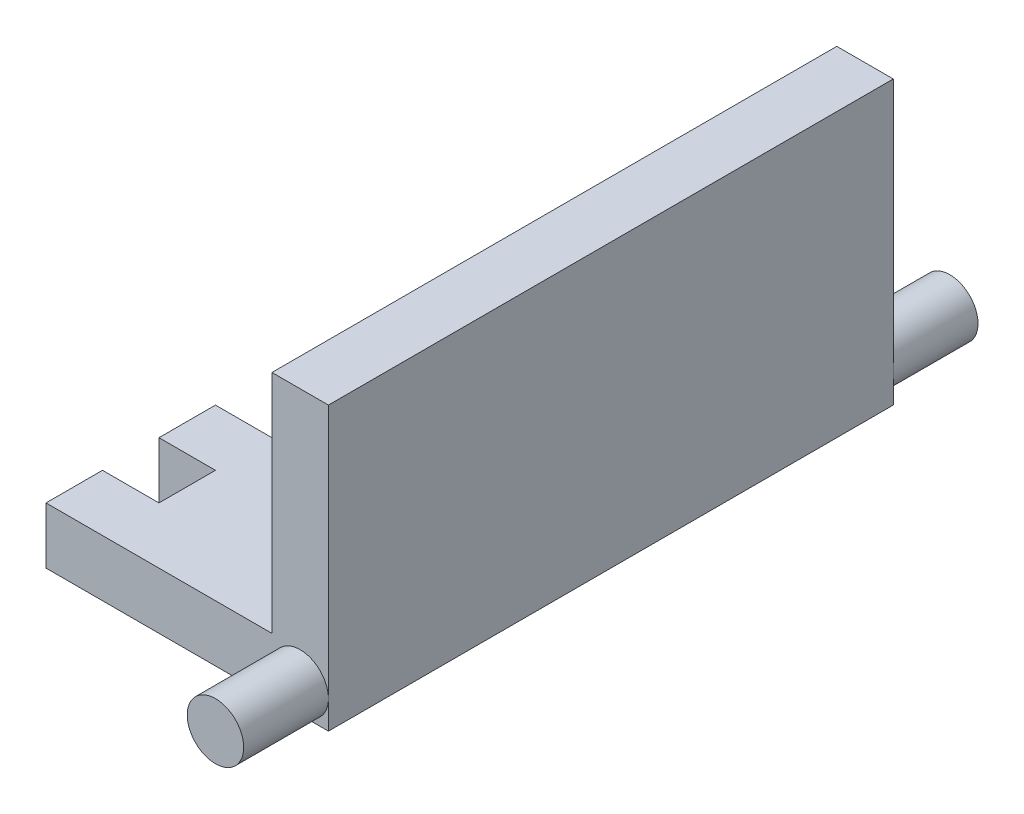
ISO-10303-21;
HEADER;
FILE_DESCRIPTION(('STEP AP214'),'2;1');
FILE_NAME('part.step','',(''),(''),'','','');
FILE_SCHEMA(('AUTOMOTIVE_DESIGN { 1 0 10303 214 1 1 1 1 }'));
ENDSEC;
DATA;
#1=APPLICATION_CONTEXT('core data for automotive mechanical design processes');
#2=APPLICATION_PROTOCOL_DEFINITION('international standard','automotive_design',2000,#1);
#3=PRODUCT_CONTEXT('',#1,'mechanical');
#4=PRODUCT('Part','Part','',(#3));
#5=PRODUCT_RELATED_PRODUCT_CATEGORY('part','',(#4));
#6=PRODUCT_DEFINITION_FORMATION('','',#4);
#7=PRODUCT_DEFINITION_CONTEXT('part definition',#1,'design');
#8=PRODUCT_DEFINITION('design','',#6,#7);
#9=PRODUCT_DEFINITION_SHAPE('','',#8);
#10=(LENGTH_UNIT() NAMED_UNIT(*) SI_UNIT(.MILLI.,.METRE.));
#11=(NAMED_UNIT(*) PLANE_ANGLE_UNIT() SI_UNIT($,.RADIAN.));
#12=(NAMED_UNIT(*) SI_UNIT($,.STERADIAN.) SOLID_ANGLE_UNIT());
#13=UNCERTAINTY_MEASURE_WITH_UNIT(LENGTH_MEASURE(1.E-05),#10,'distance_accuracy_value','');
#14=(GEOMETRIC_REPRESENTATION_CONTEXT(3) GLOBAL_UNCERTAINTY_ASSIGNED_CONTEXT((#13)) GLOBAL_UNIT_ASSIGNED_CONTEXT((#10,
#11,#12)) REPRESENTATION_CONTEXT('',''));
#15=CARTESIAN_POINT('',(0.,0.,0.));
#16=DIRECTION('',(0.,0.,1.));
#17=DIRECTION('',(1.,0.,0.));
#18=AXIS2_PLACEMENT_3D('',#15,#16,#17);
#19=CARTESIAN_POINT('',(0.,10.,100.));
#20=DIRECTION('',(0.,-1.,0.));
#21=DIRECTION('',(1.,0.,0.));
#22=AXIS2_PLACEMENT_3D('',#19,#20,#21);
#23=PLANE('',#22);
#24=DIRECTION('',(0.,0.,1.));
#25=VECTOR('',#24,1.);
#26=CARTESIAN_POINT('',(-10.,10.,100.));
#27=LINE('',#26,#25);
#28=CARTESIAN_POINT('',(-10.,10.,0.));
#29=VERTEX_POINT('',#28);
#30=CARTESIAN_POINT('',(-10.,10.,100.));
#31=VERTEX_POINT('',#30);
#32=EDGE_CURVE('E234',#29,#31,#27,.T.);
#33=ORIENTED_EDGE('',*,*,#32,.F.);
#34=DIRECTION('',(-1.,0.,0.));
#35=VECTOR('',#34,1.);
#36=CARTESIAN_POINT('',(0.,10.,0.));
#37=LINE('',#36,#35);
#38=CARTESIAN_POINT('',(-40.,9.99999999999999,0.));
#39=VERTEX_POINT('',#38);
#40=EDGE_CURVE('E353',#29,#39,#37,.T.);
#41=ORIENTED_EDGE('',*,*,#40,.T.);
#42=DIRECTION('',(0.,0.,-1.));
#43=VECTOR('',#42,1.);
#44=CARTESIAN_POINT('',(-40.,9.99999999999999,0.));
#45=LINE('',#44,#43);
#46=CARTESIAN_POINT('',(-40.,9.99999999999999,10.));
#47=VERTEX_POINT('',#46);
#48=EDGE_CURVE('E316',#47,#39,#45,.T.);
#49=ORIENTED_EDGE('',*,*,#48,.F.);
#50=DIRECTION('',(1.,0.,0.));
#51=VECTOR('',#50,1.);
#52=CARTESIAN_POINT('',(-50.,9.99999999999999,10.));
#53=LINE('',#52,#51);
#54=CARTESIAN_POINT('',(-50.,9.99999999999999,10.));
#55=VERTEX_POINT('',#54);
#56=EDGE_CURVE('E307',#55,#47,#53,.T.);
#57=ORIENTED_EDGE('',*,*,#56,.F.);
#58=DIRECTION('',(0.,0.,-1.));
#59=VECTOR('',#58,1.);
#60=CARTESIAN_POINT('',(-50.,9.99999999999999,100.));
#61=LINE('',#60,#59);
#62=CARTESIAN_POINT('',(-50.,9.99999999999999,20.));
#63=VERTEX_POINT('',#62);
#64=EDGE_CURVE('E363',#63,#55,#61,.T.);
#65=ORIENTED_EDGE('',*,*,#64,.F.);
#66=DIRECTION('',(-1.,0.,0.));
#67=VECTOR('',#66,1.);
#68=CARTESIAN_POINT('',(-50.,9.99999999999999,20.));
#69=LINE('',#68,#67);
#70=CARTESIAN_POINT('',(-40.,9.99999999999999,20.));
#71=VERTEX_POINT('',#70);
#72=EDGE_CURVE('E301',#71,#63,#69,.T.);
#73=ORIENTED_EDGE('',*,*,#72,.F.);
#74=DIRECTION('',(0.,0.,-1.));
#75=VECTOR('',#74,1.);
#76=CARTESIAN_POINT('',(-40.,9.99999999999999,20.));
#77=LINE('',#76,#75);
#78=CARTESIAN_POINT('',(-40.,9.99999999999999,30.));
#79=VERTEX_POINT('',#78);
#80=EDGE_CURVE('E298',#79,#71,#77,.T.);
#81=ORIENTED_EDGE('',*,*,#80,.F.);
#82=DIRECTION('',(1.,0.,0.));
#83=VECTOR('',#82,1.);
#84=CARTESIAN_POINT('',(-50.,9.99999999999999,30.));
#85=LINE('',#84,#83);
#86=CARTESIAN_POINT('',(-50.,9.99999999999999,30.));
#87=VERTEX_POINT('',#86);
#88=EDGE_CURVE('E289',#87,#79,#85,.T.);
#89=ORIENTED_EDGE('',*,*,#88,.F.);
#90=CARTESIAN_POINT('',(-50.,9.99999999999999,40.));
#91=VERTEX_POINT('',#90);
#92=EDGE_CURVE('E421',#91,#87,#61,.T.);
#93=ORIENTED_EDGE('',*,*,#92,.F.);
#94=DIRECTION('',(-1.,0.,0.));
#95=VECTOR('',#94,1.);
#96=CARTESIAN_POINT('',(-50.,9.99999999999999,40.));
#97=LINE('',#96,#95);
#98=CARTESIAN_POINT('',(-40.,9.99999999999999,40.));
#99=VERTEX_POINT('',#98);
#100=EDGE_CURVE('E283',#99,#91,#97,.T.);
#101=ORIENTED_EDGE('',*,*,#100,.F.);
#102=DIRECTION('',(0.,0.,-1.));
#103=VECTOR('',#102,1.);
#104=CARTESIAN_POINT('',(-40.,9.99999999999999,40.));
#105=LINE('',#104,#103);
#106=CARTESIAN_POINT('',(-40.,9.99999999999999,50.));
#107=VERTEX_POINT('',#106);
#108=EDGE_CURVE('E280',#107,#99,#105,.T.);
#109=ORIENTED_EDGE('',*,*,#108,.F.);
#110=DIRECTION('',(1.,0.,0.));
#111=VECTOR('',#110,1.);
#112=CARTESIAN_POINT('',(-50.,9.99999999999999,50.));
#113=LINE('',#112,#111);
#114=CARTESIAN_POINT('',(-50.,9.99999999999999,50.));
#115=VERTEX_POINT('',#114);
#116=EDGE_CURVE('E271',#115,#107,#113,.T.);
#117=ORIENTED_EDGE('',*,*,#116,.F.);
#118=CARTESIAN_POINT('',(-50.,9.99999999999999,60.));
#119=VERTEX_POINT('',#118);
#120=EDGE_CURVE('E420',#119,#115,#61,.T.);
#121=ORIENTED_EDGE('',*,*,#120,.F.);
#122=DIRECTION('',(-1.,0.,0.));
#123=VECTOR('',#122,1.);
#124=CARTESIAN_POINT('',(-50.,9.99999999999999,60.));
#125=LINE('',#124,#123);
#126=CARTESIAN_POINT('',(-40.,9.99999999999999,60.));
#127=VERTEX_POINT('',#126);
#128=EDGE_CURVE('E265',#127,#119,#125,.T.);
#129=ORIENTED_EDGE('',*,*,#128,.F.);
#130=DIRECTION('',(0.,0.,-1.));
#131=VECTOR('',#130,1.);
#132=CARTESIAN_POINT('',(-40.,9.99999999999999,60.));
#133=LINE('',#132,#131);
#134=CARTESIAN_POINT('',(-40.,9.99999999999999,70.));
#135=VERTEX_POINT('',#134);
#136=EDGE_CURVE('E262',#135,#127,#133,.T.);
#137=ORIENTED_EDGE('',*,*,#136,.F.);
#138=DIRECTION('',(1.,0.,0.));
#139=VECTOR('',#138,1.);
#140=CARTESIAN_POINT('',(-50.,9.99999999999999,70.));
#141=LINE('',#140,#139);
#142=CARTESIAN_POINT('',(-50.,9.99999999999999,70.));
#143=VERTEX_POINT('',#142);
#144=EDGE_CURVE('E255',#143,#135,#141,.T.);
#145=ORIENTED_EDGE('',*,*,#144,.F.);
#146=CARTESIAN_POINT('',(-50.,9.99999999999999,80.));
#147=VERTEX_POINT('',#146);
#148=EDGE_CURVE('E368',#147,#143,#61,.T.);
#149=ORIENTED_EDGE('',*,*,#148,.F.);
#150=DIRECTION('',(-1.,0.,0.));
#151=VECTOR('',#150,1.);
#152=CARTESIAN_POINT('',(-50.,9.99999999999999,80.));
#153=LINE('',#152,#151);
#154=CARTESIAN_POINT('',(-40.,9.99999999999999,80.));
#155=VERTEX_POINT('',#154);
#156=EDGE_CURVE('E249',#155,#147,#153,.T.);
#157=ORIENTED_EDGE('',*,*,#156,.F.);
#158=DIRECTION('',(0.,0.,-1.));
#159=VECTOR('',#158,1.);
#160=CARTESIAN_POINT('',(-40.,9.99999999999999,80.));
#161=LINE('',#160,#159);
#162=CARTESIAN_POINT('',(-40.,9.99999999999999,90.));
#163=VERTEX_POINT('',#162);
#164=EDGE_CURVE('E246',#163,#155,#161,.T.);
#165=ORIENTED_EDGE('',*,*,#164,.F.);
#166=DIRECTION('',(1.,0.,0.));
#167=VECTOR('',#166,1.);
#168=CARTESIAN_POINT('',(-50.,9.99999999999999,90.));
#169=LINE('',#168,#167);
#170=CARTESIAN_POINT('',(-50.,9.99999999999999,90.));
#171=VERTEX_POINT('',#170);
#172=EDGE_CURVE('E244',#171,#163,#169,.T.);
#173=ORIENTED_EDGE('',*,*,#172,.F.);
#174=CARTESIAN_POINT('',(-50.,9.99999999999999,100.));
#175=VERTEX_POINT('',#174);
#176=EDGE_CURVE('E365',#175,#171,#61,.T.);
#177=ORIENTED_EDGE('',*,*,#176,.F.);
#178=DIRECTION('',(-1.,0.,0.));
#179=VECTOR('',#178,1.);
#180=CARTESIAN_POINT('',(0.,10.,100.));
#181=LINE('',#180,#179);
#182=EDGE_CURVE('E48',#31,#175,#181,.T.);
#183=ORIENTED_EDGE('',*,*,#182,.F.);
#184=EDGE_LOOP('',(#33,#41,#49,#57,#65,#73,#81,#89,#93,#101,#109,#117,#121,#129,#137,#145,#149,
#157,#165,#173,#177,#183));
#185=FACE_BOUND('',#184,.T.);
#186=ADVANCED_FACE('F33',(#185),#23,.F.);
#187=CARTESIAN_POINT('',(-50.,0.,100.));
#188=DIRECTION('',(1.,0.,0.));
#189=DIRECTION('',(0.,0.,-1.));
#190=AXIS2_PLACEMENT_3D('',#187,#188,#189);
#191=PLANE('',#190);
#192=DIRECTION('',(0.,0.,-1.));
#193=VECTOR('',#192,1.);
#194=CARTESIAN_POINT('',(-50.,0.,100.));
#195=LINE('',#194,#193);
#196=CARTESIAN_POINT('',(-50.,0.,80.));
#197=VERTEX_POINT('',#196);
#198=CARTESIAN_POINT('',(-50.,0.,70.));
#199=VERTEX_POINT('',#198);
#200=EDGE_CURVE('E364',#197,#199,#195,.T.);
#201=ORIENTED_EDGE('',*,*,#200,.F.);
#202=DIRECTION('',(0.,1.,0.));
#203=VECTOR('',#202,1.);
#204=CARTESIAN_POINT('',(-50.,-5.00000000000001,80.));
#205=LINE('',#204,#203);
#206=EDGE_CURVE('E252',#197,#147,#205,.T.);
#207=ORIENTED_EDGE('',*,*,#206,.T.);
#208=ORIENTED_EDGE('',*,*,#148,.T.);
#209=DIRECTION('',(0.,1.,0.));
#210=VECTOR('',#209,1.);
#211=CARTESIAN_POINT('',(-50.,-5.00000000000001,70.));
#212=LINE('',#211,#210);
#213=EDGE_CURVE('E267',#199,#143,#212,.T.);
#214=ORIENTED_EDGE('',*,*,#213,.F.);
#215=EDGE_LOOP('',(#201,#207,#208,#214));
#216=FACE_BOUND('',#215,.T.);
#217=ADVANCED_FACE('F416',(#216),#191,.F.);
#218=CARTESIAN_POINT('',(-50.,0.,60.));
#219=VERTEX_POINT('',#218);
#220=CARTESIAN_POINT('',(-50.,0.,50.));
#221=VERTEX_POINT('',#220);
#222=EDGE_CURVE('E445',#219,#221,#195,.T.);
#223=ORIENTED_EDGE('',*,*,#222,.F.);
#224=DIRECTION('',(0.,1.,0.));
#225=VECTOR('',#224,1.);
#226=CARTESIAN_POINT('',(-50.,-5.00000000000001,60.));
#227=LINE('',#226,#225);
#228=EDGE_CURVE('E268',#219,#119,#227,.T.);
#229=ORIENTED_EDGE('',*,*,#228,.T.);
#230=ORIENTED_EDGE('',*,*,#120,.T.);
#231=DIRECTION('',(0.,1.,0.));
#232=VECTOR('',#231,1.);
#233=CARTESIAN_POINT('',(-50.,-5.,50.));
#234=LINE('',#233,#232);
#235=EDGE_CURVE('E285',#221,#115,#234,.T.);
#236=ORIENTED_EDGE('',*,*,#235,.F.);
#237=EDGE_LOOP('',(#223,#229,#230,#236));
#238=FACE_BOUND('',#237,.T.);
#239=ADVANCED_FACE('F458',(#238),#191,.F.);
#240=CARTESIAN_POINT('',(-50.,0.,40.));
#241=VERTEX_POINT('',#240);
#242=CARTESIAN_POINT('',(-50.,0.,30.));
#243=VERTEX_POINT('',#242);
#244=EDGE_CURVE('E444',#241,#243,#195,.T.);
#245=ORIENTED_EDGE('',*,*,#244,.F.);
#246=DIRECTION('',(0.,1.,0.));
#247=VECTOR('',#246,1.);
#248=CARTESIAN_POINT('',(-50.,-5.,40.));
#249=LINE('',#248,#247);
#250=EDGE_CURVE('E286',#241,#91,#249,.T.);
#251=ORIENTED_EDGE('',*,*,#250,.T.);
#252=ORIENTED_EDGE('',*,*,#92,.T.);
#253=DIRECTION('',(0.,1.,0.));
#254=VECTOR('',#253,1.);
#255=CARTESIAN_POINT('',(-50.,-5.,30.));
#256=LINE('',#255,#254);
#257=EDGE_CURVE('E303',#243,#87,#256,.T.);
#258=ORIENTED_EDGE('',*,*,#257,.F.);
#259=EDGE_LOOP('',(#245,#251,#252,#258));
#260=FACE_BOUND('',#259,.T.);
#261=ADVANCED_FACE('F470',(#260),#191,.F.);
#262=CARTESIAN_POINT('',(-50.,0.,20.));
#263=VERTEX_POINT('',#262);
#264=CARTESIAN_POINT('',(-50.,0.,10.));
#265=VERTEX_POINT('',#264);
#266=EDGE_CURVE('E359',#263,#265,#195,.T.);
#267=ORIENTED_EDGE('',*,*,#266,.F.);
#268=DIRECTION('',(0.,1.,0.));
#269=VECTOR('',#268,1.);
#270=CARTESIAN_POINT('',(-50.,-5.,20.));
#271=LINE('',#270,#269);
#272=EDGE_CURVE('E304',#263,#63,#271,.T.);
#273=ORIENTED_EDGE('',*,*,#272,.T.);
#274=ORIENTED_EDGE('',*,*,#64,.T.);
#275=DIRECTION('',(0.,1.,0.));
#276=VECTOR('',#275,1.);
#277=CARTESIAN_POINT('',(-50.,-5.,10.));
#278=LINE('',#277,#276);
#279=EDGE_CURVE('E319',#265,#55,#278,.T.);
#280=ORIENTED_EDGE('',*,*,#279,.F.);
#281=EDGE_LOOP('',(#267,#273,#274,#280));
#282=FACE_BOUND('',#281,.T.);
#283=ADVANCED_FACE('F432',(#282),#191,.F.);
#284=CARTESIAN_POINT('',(0.,0.,0.));
#285=DIRECTION('',(0.,0.,1.));
#286=DIRECTION('',(1.,0.,0.));
#287=AXIS2_PLACEMENT_3D('',#284,#285,#286);
#288=PLANE('',#287);
#289=CARTESIAN_POINT('',(-5.,5.,0.));
#290=DIRECTION('',(0.,0.,-1.));
#291=DIRECTION('',(-1.,0.,0.));
#292=AXIS2_PLACEMENT_3D('',#289,#290,#291);
#293=CIRCLE('',#292,5.);
#294=CARTESIAN_POINT('',(0.,5.,0.));
#295=VERTEX_POINT('',#294);
#296=CARTESIAN_POINT('',(-5.,0.,0.));
#297=VERTEX_POINT('',#296);
#298=EDGE_CURVE('E330',#295,#297,#293,.T.);
#299=ORIENTED_EDGE('',*,*,#298,.F.);
#300=DIRECTION('',(0.,1.,0.));
#301=VECTOR('',#300,1.);
#302=CARTESIAN_POINT('',(0.,0.,0.));
#303=LINE('',#302,#301);
#304=CARTESIAN_POINT('',(0.,0.,0.));
#305=VERTEX_POINT('',#304);
#306=EDGE_CURVE('E215',#305,#295,#303,.T.);
#307=ORIENTED_EDGE('',*,*,#306,.F.);
#308=DIRECTION('',(1.,0.,0.));
#309=VECTOR('',#308,1.);
#310=CARTESIAN_POINT('',(0.,0.,0.));
#311=LINE('',#310,#309);
#312=EDGE_CURVE('E355',#297,#305,#311,.T.);
#313=ORIENTED_EDGE('',*,*,#312,.F.);
#314=EDGE_LOOP('',(#299,#307,#313));
#315=FACE_BOUND('',#314,.T.);
#316=ADVANCED_FACE('F507',(#315),#288,.F.);
#317=CARTESIAN_POINT('',(0.,0.,100.));
#318=DIRECTION('',(0.,0.,1.));
#319=DIRECTION('',(1.,0.,0.));
#320=AXIS2_PLACEMENT_3D('',#317,#318,#319);
#321=PLANE('',#320);
#322=CARTESIAN_POINT('',(-5.,5.,100.));
#323=DIRECTION('',(0.,0.,1.));
#324=DIRECTION('',(1.,0.,0.));
#325=AXIS2_PLACEMENT_3D('',#322,#323,#324);
#326=CIRCLE('',#325,5.);
#327=CARTESIAN_POINT('',(0.,5.,100.));
#328=VERTEX_POINT('',#327);
#329=CARTESIAN_POINT('',(-5.,0.,100.));
#330=VERTEX_POINT('',#329);
#331=EDGE_CURVE('E337',#328,#330,#326,.T.);
#332=ORIENTED_EDGE('',*,*,#331,.F.);
#333=DIRECTION('',(0.,1.,0.));
#334=VECTOR('',#333,1.);
#335=CARTESIAN_POINT('',(0.,0.,100.));
#336=LINE('',#335,#334);
#337=CARTESIAN_POINT('',(0.,50.,100.));
#338=VERTEX_POINT('',#337);
#339=EDGE_CURVE('E344',#328,#338,#336,.T.);
#340=ORIENTED_EDGE('',*,*,#339,.T.);
#341=DIRECTION('',(1.,0.,0.));
#342=VECTOR('',#341,1.);
#343=CARTESIAN_POINT('',(0.,50.,100.));
#344=LINE('',#343,#342);
#345=CARTESIAN_POINT('',(-10.,50.,100.));
#346=VERTEX_POINT('',#345);
#347=EDGE_CURVE('E233',#346,#338,#344,.T.);
#348=ORIENTED_EDGE('',*,*,#347,.F.);
#349=DIRECTION('',(0.,-1.,0.));
#350=VECTOR('',#349,1.);
#351=CARTESIAN_POINT('',(-10.,50.,100.));
#352=LINE('',#351,#350);
#353=EDGE_CURVE('E239',#346,#31,#352,.T.);
#354=ORIENTED_EDGE('',*,*,#353,.T.);
#355=ORIENTED_EDGE('',*,*,#182,.T.);
#356=DIRECTION('',(0.,-1.,0.));
#357=VECTOR('',#356,1.);
#358=CARTESIAN_POINT('',(-50.,0.,100.));
#359=LINE('',#358,#357);
#360=CARTESIAN_POINT('',(-50.,0.,100.));
#361=VERTEX_POINT('',#360);
#362=EDGE_CURVE('E346',#175,#361,#359,.T.);
#363=ORIENTED_EDGE('',*,*,#362,.T.);
#364=DIRECTION('',(1.,0.,0.));
#365=VECTOR('',#364,1.);
#366=CARTESIAN_POINT('',(0.,0.,100.));
#367=LINE('',#366,#365);
#368=EDGE_CURVE('E349',#361,#330,#367,.T.);
#369=ORIENTED_EDGE('',*,*,#368,.T.);
#370=EDGE_LOOP('',(#332,#340,#348,#354,#355,#363,#369));
#371=FACE_BOUND('',#370,.T.);
#372=ADVANCED_FACE('F511',(#371),#321,.T.);
#373=CARTESIAN_POINT('',(0.,0.,100.));
#374=DIRECTION('',(-1.,0.,0.));
#375=DIRECTION('',(0.,0.,1.));
#376=AXIS2_PLACEMENT_3D('',#373,#374,#375);
#377=PLANE('',#376);
#378=ORIENTED_EDGE('',*,*,#306,.T.);
#379=CARTESIAN_POINT('',(0.,50.,0.));
#380=VERTEX_POINT('',#379);
#381=EDGE_CURVE('E208',#295,#380,#303,.T.);
#382=ORIENTED_EDGE('',*,*,#381,.T.);
#383=DIRECTION('',(0.,0.,-1.));
#384=VECTOR('',#383,1.);
#385=CARTESIAN_POINT('',(0.,50.,100.));
#386=LINE('',#385,#384);
#387=EDGE_CURVE('E212',#338,#380,#386,.T.);
#388=ORIENTED_EDGE('',*,*,#387,.F.);
#389=ORIENTED_EDGE('',*,*,#339,.F.);
#390=CARTESIAN_POINT('',(0.,0.,100.));
#391=VERTEX_POINT('',#390);
#392=EDGE_CURVE('E341',#391,#328,#336,.T.);
#393=ORIENTED_EDGE('',*,*,#392,.F.);
#394=DIRECTION('',(0.,0.,-1.));
#395=VECTOR('',#394,1.);
#396=CARTESIAN_POINT('',(0.,0.,100.));
#397=LINE('',#396,#395);
#398=EDGE_CURVE('E351',#391,#305,#397,.T.);
#399=ORIENTED_EDGE('',*,*,#398,.T.);
#400=EDGE_LOOP('',(#378,#382,#388,#389,#393,#399));
#401=FACE_BOUND('',#400,.T.);
#402=ADVANCED_FACE('F35',(#401),#377,.F.);
#403=ORIENTED_EDGE('',*,*,#176,.T.);
#404=DIRECTION('',(0.,1.,0.));
#405=VECTOR('',#404,1.);
#406=CARTESIAN_POINT('',(-50.,-5.00000000000001,90.));
#407=LINE('',#406,#405);
#408=CARTESIAN_POINT('',(-50.,0.,90.));
#409=VERTEX_POINT('',#408);
#410=EDGE_CURVE('E251',#409,#171,#407,.T.);
#411=ORIENTED_EDGE('',*,*,#410,.F.);
#412=EDGE_CURVE('E360',#361,#409,#195,.T.);
#413=ORIENTED_EDGE('',*,*,#412,.F.);
#414=ORIENTED_EDGE('',*,*,#362,.F.);
#415=EDGE_LOOP('',(#403,#411,#413,#414));
#416=FACE_BOUND('',#415,.T.);
#417=ADVANCED_FACE('F497',(#416),#191,.F.);
#418=CARTESIAN_POINT('',(0.,0.,100.));
#419=DIRECTION('',(0.,1.,0.));
#420=DIRECTION('',(-1.,0.,0.));
#421=AXIS2_PLACEMENT_3D('',#418,#419,#420);
#422=PLANE('',#421);
#423=DIRECTION('',(0.,0.,-1.));
#424=VECTOR('',#423,1.);
#425=CARTESIAN_POINT('',(-40.,0.,100.));
#426=LINE('',#425,#424);
#427=CARTESIAN_POINT('',(-40.,0.,90.));
#428=VERTEX_POINT('',#427);
#429=CARTESIAN_POINT('',(-40.,0.,80.));
#430=VERTEX_POINT('',#429);
#431=EDGE_CURVE('E41',#428,#430,#426,.T.);
#432=ORIENTED_EDGE('',*,*,#431,.T.);
#433=DIRECTION('',(-1.,0.,0.));
#434=VECTOR('',#433,1.);
#435=CARTESIAN_POINT('',(0.,0.,80.));
#436=LINE('',#435,#434);
#437=EDGE_CURVE('E11',#430,#197,#436,.T.);
#438=ORIENTED_EDGE('',*,*,#437,.T.);
#439=ORIENTED_EDGE('',*,*,#200,.T.);
#440=DIRECTION('',(1.,0.,0.));
#441=VECTOR('',#440,1.);
#442=CARTESIAN_POINT('',(0.,0.,70.));
#443=LINE('',#442,#441);
#444=CARTESIAN_POINT('',(-40.,0.,70.));
#445=VERTEX_POINT('',#444);
#446=EDGE_CURVE('E392',#199,#445,#443,.T.);
#447=ORIENTED_EDGE('',*,*,#446,.T.);
#448=DIRECTION('',(0.,0.,-1.));
#449=VECTOR('',#448,1.);
#450=CARTESIAN_POINT('',(-40.,0.,100.));
#451=LINE('',#450,#449);
#452=CARTESIAN_POINT('',(-40.,0.,60.));
#453=VERTEX_POINT('',#452);
#454=EDGE_CURVE('E395',#445,#453,#451,.T.);
#455=ORIENTED_EDGE('',*,*,#454,.T.);
#456=DIRECTION('',(-1.,0.,0.));
#457=VECTOR('',#456,1.);
#458=CARTESIAN_POINT('',(0.,0.,60.));
#459=LINE('',#458,#457);
#460=EDGE_CURVE('E398',#453,#219,#459,.T.);
#461=ORIENTED_EDGE('',*,*,#460,.T.);
#462=ORIENTED_EDGE('',*,*,#222,.T.);
#463=DIRECTION('',(1.,0.,0.));
#464=VECTOR('',#463,1.);
#465=CARTESIAN_POINT('',(0.,0.,50.));
#466=LINE('',#465,#464);
#467=CARTESIAN_POINT('',(-40.,0.,50.));
#468=VERTEX_POINT('',#467);
#469=EDGE_CURVE('E383',#221,#468,#466,.T.);
#470=ORIENTED_EDGE('',*,*,#469,.T.);
#471=DIRECTION('',(0.,0.,-1.));
#472=VECTOR('',#471,1.);
#473=CARTESIAN_POINT('',(-40.,0.,100.));
#474=LINE('',#473,#472);
#475=CARTESIAN_POINT('',(-40.,0.,40.));
#476=VERTEX_POINT('',#475);
#477=EDGE_CURVE('E386',#468,#476,#474,.T.);
#478=ORIENTED_EDGE('',*,*,#477,.T.);
#479=DIRECTION('',(-1.,0.,0.));
#480=VECTOR('',#479,1.);
#481=CARTESIAN_POINT('',(0.,0.,40.));
#482=LINE('',#481,#480);
#483=EDGE_CURVE('E389',#476,#241,#482,.T.);
#484=ORIENTED_EDGE('',*,*,#483,.T.);
#485=ORIENTED_EDGE('',*,*,#244,.T.);
#486=DIRECTION('',(1.,0.,0.));
#487=VECTOR('',#486,1.);
#488=CARTESIAN_POINT('',(0.,0.,30.));
#489=LINE('',#488,#487);
#490=CARTESIAN_POINT('',(-40.,0.,30.));
#491=VERTEX_POINT('',#490);
#492=EDGE_CURVE('E374',#243,#491,#489,.T.);
#493=ORIENTED_EDGE('',*,*,#492,.T.);
#494=DIRECTION('',(0.,0.,-1.));
#495=VECTOR('',#494,1.);
#496=CARTESIAN_POINT('',(-40.,0.,100.));
#497=LINE('',#496,#495);
#498=CARTESIAN_POINT('',(-40.,0.,20.));
#499=VERTEX_POINT('',#498);
#500=EDGE_CURVE('E377',#491,#499,#497,.T.);
#501=ORIENTED_EDGE('',*,*,#500,.T.);
#502=DIRECTION('',(-1.,0.,0.));
#503=VECTOR('',#502,1.);
#504=CARTESIAN_POINT('',(0.,0.,20.));
#505=LINE('',#504,#503);
#506=EDGE_CURVE('E380',#499,#263,#505,.T.);
#507=ORIENTED_EDGE('',*,*,#506,.T.);
#508=ORIENTED_EDGE('',*,*,#266,.T.);
#509=DIRECTION('',(1.,0.,0.));
#510=VECTOR('',#509,1.);
#511=CARTESIAN_POINT('',(0.,0.,9.99999999999999));
#512=LINE('',#511,#510);
#513=CARTESIAN_POINT('',(-40.,0.,10.));
#514=VERTEX_POINT('',#513);
#515=EDGE_CURVE('E371',#265,#514,#512,.T.);
#516=ORIENTED_EDGE('',*,*,#515,.T.);
#517=DIRECTION('',(0.,0.,-1.));
#518=VECTOR('',#517,1.);
#519=CARTESIAN_POINT('',(-40.,0.,100.));
#520=LINE('',#519,#518);
#521=CARTESIAN_POINT('',(-40.,0.,0.));
#522=VERTEX_POINT('',#521);
#523=EDGE_CURVE('E322',#514,#522,#520,.T.);
#524=ORIENTED_EDGE('',*,*,#523,.T.);
#525=EDGE_CURVE('E356',#522,#297,#311,.T.);
#526=ORIENTED_EDGE('',*,*,#525,.T.);
#527=ORIENTED_EDGE('',*,*,#312,.T.);
#528=ORIENTED_EDGE('',*,*,#398,.F.);
#529=EDGE_CURVE('E348',#330,#391,#367,.T.);
#530=ORIENTED_EDGE('',*,*,#529,.F.);
#531=ORIENTED_EDGE('',*,*,#368,.F.);
#532=ORIENTED_EDGE('',*,*,#412,.T.);
#533=DIRECTION('',(1.,0.,0.));
#534=VECTOR('',#533,1.);
#535=CARTESIAN_POINT('',(0.,0.,90.));
#536=LINE('',#535,#534);
#537=EDGE_CURVE('E401',#409,#428,#536,.T.);
#538=ORIENTED_EDGE('',*,*,#537,.T.);
#539=EDGE_LOOP('',(#432,#438,#439,#447,#455,#461,#462,#470,#478,#484,#485,#493,#501,#507,#508,
#516,#524,#526,#527,#528,#530,#531,#532,#538));
#540=FACE_BOUND('',#539,.T.);
#541=ADVANCED_FACE('F405',(#540),#422,.F.);
#542=EDGE_CURVE('E340',#330,#328,#326,.T.);
#543=ORIENTED_EDGE('',*,*,#542,.F.);
#544=ORIENTED_EDGE('',*,*,#529,.T.);
#545=ORIENTED_EDGE('',*,*,#392,.T.);
#546=EDGE_LOOP('',(#543,#544,#545));
#547=FACE_BOUND('',#546,.T.);
#548=ADVANCED_FACE('F503',(#547),#321,.T.);
#549=ORIENTED_EDGE('',*,*,#525,.F.);
#550=DIRECTION('',(0.,1.,0.));
#551=VECTOR('',#550,1.);
#552=CARTESIAN_POINT('',(-40.,0.,0.));
#553=LINE('',#552,#551);
#554=EDGE_CURVE('E333',#522,#39,#553,.T.);
#555=ORIENTED_EDGE('',*,*,#554,.T.);
#556=ORIENTED_EDGE('',*,*,#40,.F.);
#557=DIRECTION('',(0.,-1.,0.));
#558=VECTOR('',#557,1.);
#559=CARTESIAN_POINT('',(-10.,50.,0.));
#560=LINE('',#559,#558);
#561=CARTESIAN_POINT('',(-10.,50.,0.));
#562=VERTEX_POINT('',#561);
#563=EDGE_CURVE('E225',#562,#29,#560,.T.);
#564=ORIENTED_EDGE('',*,*,#563,.F.);
#565=DIRECTION('',(-1.,0.,0.));
#566=VECTOR('',#565,1.);
#567=CARTESIAN_POINT('',(0.,50.,0.));
#568=LINE('',#567,#566);
#569=EDGE_CURVE('E221',#380,#562,#568,.T.);
#570=ORIENTED_EDGE('',*,*,#569,.F.);
#571=ORIENTED_EDGE('',*,*,#381,.F.);
#572=EDGE_CURVE('E334',#297,#295,#293,.T.);
#573=ORIENTED_EDGE('',*,*,#572,.F.);
#574=EDGE_LOOP('',(#549,#555,#556,#564,#570,#571,#573));
#575=FACE_BOUND('',#574,.T.);
#576=ADVANCED_FACE('F223',(#575),#288,.F.);
#577=CARTESIAN_POINT('',(-5.,5.,115.));
#578=DIRECTION('',(0.,0.,-1.));
#579=DIRECTION('',(-1.,0.,0.));
#580=AXIS2_PLACEMENT_3D('',#577,#578,#579);
#581=CYLINDRICAL_SURFACE('',#580,5.);
#582=CARTESIAN_POINT('',(-5.,5.,115.));
#583=DIRECTION('',(0.,0.,1.));
#584=DIRECTION('',(1.,0.,0.));
#585=AXIS2_PLACEMENT_3D('',#582,#583,#584);
#586=CIRCLE('',#585,5.);
#587=CARTESIAN_POINT('',(0.,5.,115.));
#588=VERTEX_POINT('',#587);
#589=EDGE_CURVE('E218',#588,#588,#586,.T.);
#590=ORIENTED_EDGE('',*,*,#589,.F.);
#591=EDGE_LOOP('',(#590));
#592=FACE_BOUND('',#591,.T.);
#593=ORIENTED_EDGE('',*,*,#542,.T.);
#594=ORIENTED_EDGE('',*,*,#331,.T.);
#595=EDGE_LOOP('',(#593,#594));
#596=FACE_BOUND('',#595,.T.);
#597=ADVANCED_FACE('F506',(#592,#596),#581,.T.);
#598=CARTESIAN_POINT('',(-5.,5.,115.));
#599=DIRECTION('',(0.,0.,1.));
#600=DIRECTION('',(1.,0.,0.));
#601=AXIS2_PLACEMENT_3D('',#598,#599,#600);
#602=PLANE('',#601);
#603=ORIENTED_EDGE('',*,*,#589,.T.);
#604=EDGE_LOOP('',(#603));
#605=FACE_BOUND('',#604,.T.);
#606=ADVANCED_FACE('F514',(#605),#602,.T.);
#607=CARTESIAN_POINT('',(-5.,5.,-15.));
#608=DIRECTION('',(0.,0.,1.));
#609=DIRECTION('',(1.,0.,0.));
#610=AXIS2_PLACEMENT_3D('',#607,#608,#609);
#611=CYLINDRICAL_SURFACE('',#610,5.);
#612=CARTESIAN_POINT('',(-5.,5.,-15.));
#613=DIRECTION('',(0.,0.,-1.));
#614=DIRECTION('',(-1.,0.,0.));
#615=AXIS2_PLACEMENT_3D('',#612,#613,#614);
#616=CIRCLE('',#615,5.);
#617=CARTESIAN_POINT('',(-10.,5.,-15.));
#618=VERTEX_POINT('',#617);
#619=EDGE_CURVE('E327',#618,#618,#616,.T.);
#620=ORIENTED_EDGE('',*,*,#619,.F.);
#621=EDGE_LOOP('',(#620));
#622=FACE_BOUND('',#621,.T.);
#623=ORIENTED_EDGE('',*,*,#572,.T.);
#624=ORIENTED_EDGE('',*,*,#298,.T.);
#625=EDGE_LOOP('',(#623,#624));
#626=FACE_BOUND('',#625,.T.);
#627=ADVANCED_FACE('F518',(#622,#626),#611,.T.);
#628=CARTESIAN_POINT('',(-5.,5.,-15.));
#629=DIRECTION('',(0.,0.,-1.));
#630=DIRECTION('',(-1.,0.,0.));
#631=AXIS2_PLACEMENT_3D('',#628,#629,#630);
#632=PLANE('',#631);
#633=ORIENTED_EDGE('',*,*,#619,.T.);
#634=EDGE_LOOP('',(#633));
#635=FACE_BOUND('',#634,.T.);
#636=ADVANCED_FACE('F522',(#635),#632,.T.);
#637=CARTESIAN_POINT('',(-50.,-5.,10.));
#638=DIRECTION('',(0.,0.,1.));
#639=DIRECTION('',(1.,0.,0.));
#640=AXIS2_PLACEMENT_3D('',#637,#638,#639);
#641=PLANE('',#640);
#642=ORIENTED_EDGE('',*,*,#279,.T.);
#643=ORIENTED_EDGE('',*,*,#56,.T.);
#644=DIRECTION('',(0.,1.,0.));
#645=VECTOR('',#644,1.);
#646=CARTESIAN_POINT('',(-40.,-5.,10.));
#647=LINE('',#646,#645);
#648=EDGE_CURVE('E320',#514,#47,#647,.T.);
#649=ORIENTED_EDGE('',*,*,#648,.F.);
#650=ORIENTED_EDGE('',*,*,#515,.F.);
#651=EDGE_LOOP('',(#642,#643,#649,#650));
#652=FACE_BOUND('',#651,.T.);
#653=ADVANCED_FACE('F437',(#652),#641,.F.);
#654=CARTESIAN_POINT('',(-40.,-5.,0.));
#655=DIRECTION('',(1.,0.,0.));
#656=DIRECTION('',(0.,1.,0.));
#657=AXIS2_PLACEMENT_3D('',#654,#655,#656);
#658=PLANE('',#657);
#659=ORIENTED_EDGE('',*,*,#648,.T.);
#660=ORIENTED_EDGE('',*,*,#48,.T.);
#661=ORIENTED_EDGE('',*,*,#554,.F.);
#662=ORIENTED_EDGE('',*,*,#523,.F.);
#663=EDGE_LOOP('',(#659,#660,#661,#662));
#664=FACE_BOUND('',#663,.T.);
#665=ADVANCED_FACE('F441',(#664),#658,.F.);
#666=CARTESIAN_POINT('',(-50.,-5.,20.));
#667=DIRECTION('',(0.,0.,-1.));
#668=DIRECTION('',(-1.,0.,0.));
#669=AXIS2_PLACEMENT_3D('',#666,#667,#668);
#670=PLANE('',#669);
#671=DIRECTION('',(0.,1.,0.));
#672=VECTOR('',#671,1.);
#673=CARTESIAN_POINT('',(-40.,-5.,20.));
#674=LINE('',#673,#672);
#675=EDGE_CURVE('E308',#499,#71,#674,.T.);
#676=ORIENTED_EDGE('',*,*,#675,.T.);
#677=ORIENTED_EDGE('',*,*,#72,.T.);
#678=ORIENTED_EDGE('',*,*,#272,.F.);
#679=ORIENTED_EDGE('',*,*,#506,.F.);
#680=EDGE_LOOP('',(#676,#677,#678,#679));
#681=FACE_BOUND('',#680,.T.);
#682=ADVANCED_FACE('F480',(#681),#670,.F.);
#683=CARTESIAN_POINT('',(-40.,-5.,20.));
#684=DIRECTION('',(1.,0.,0.));
#685=DIRECTION('',(0.,1.,0.));
#686=AXIS2_PLACEMENT_3D('',#683,#684,#685);
#687=PLANE('',#686);
#688=DIRECTION('',(0.,1.,0.));
#689=VECTOR('',#688,1.);
#690=CARTESIAN_POINT('',(-40.,-5.,30.));
#691=LINE('',#690,#689);
#692=EDGE_CURVE('E310',#491,#79,#691,.T.);
#693=ORIENTED_EDGE('',*,*,#692,.T.);
#694=ORIENTED_EDGE('',*,*,#80,.T.);
#695=ORIENTED_EDGE('',*,*,#675,.F.);
#696=ORIENTED_EDGE('',*,*,#500,.F.);
#697=EDGE_LOOP('',(#693,#694,#695,#696));
#698=FACE_BOUND('',#697,.T.);
#699=ADVANCED_FACE('F477',(#698),#687,.F.);
#700=CARTESIAN_POINT('',(-50.,-5.,30.));
#701=DIRECTION('',(0.,0.,1.));
#702=DIRECTION('',(1.,0.,0.));
#703=AXIS2_PLACEMENT_3D('',#700,#701,#702);
#704=PLANE('',#703);
#705=ORIENTED_EDGE('',*,*,#257,.T.);
#706=ORIENTED_EDGE('',*,*,#88,.T.);
#707=ORIENTED_EDGE('',*,*,#692,.F.);
#708=ORIENTED_EDGE('',*,*,#492,.F.);
#709=EDGE_LOOP('',(#705,#706,#707,#708));
#710=FACE_BOUND('',#709,.T.);
#711=ADVANCED_FACE('F473',(#710),#704,.F.);
#712=CARTESIAN_POINT('',(-50.,-5.,40.));
#713=DIRECTION('',(0.,0.,-1.));
#714=DIRECTION('',(-1.,0.,0.));
#715=AXIS2_PLACEMENT_3D('',#712,#713,#714);
#716=PLANE('',#715);
#717=DIRECTION('',(0.,1.,0.));
#718=VECTOR('',#717,1.);
#719=CARTESIAN_POINT('',(-40.,-5.,40.));
#720=LINE('',#719,#718);
#721=EDGE_CURVE('E290',#476,#99,#720,.T.);
#722=ORIENTED_EDGE('',*,*,#721,.T.);
#723=ORIENTED_EDGE('',*,*,#100,.T.);
#724=ORIENTED_EDGE('',*,*,#250,.F.);
#725=ORIENTED_EDGE('',*,*,#483,.F.);
#726=EDGE_LOOP('',(#722,#723,#724,#725));
#727=FACE_BOUND('',#726,.T.);
#728=ADVANCED_FACE('F530',(#727),#716,.F.);
#729=CARTESIAN_POINT('',(-40.,-5.,40.));
#730=DIRECTION('',(1.,0.,0.));
#731=DIRECTION('',(0.,1.,0.));
#732=AXIS2_PLACEMENT_3D('',#729,#730,#731);
#733=PLANE('',#732);
#734=DIRECTION('',(0.,1.,0.));
#735=VECTOR('',#734,1.);
#736=CARTESIAN_POINT('',(-40.,-5.,50.));
#737=LINE('',#736,#735);
#738=EDGE_CURVE('E292',#468,#107,#737,.T.);
#739=ORIENTED_EDGE('',*,*,#738,.T.);
#740=ORIENTED_EDGE('',*,*,#108,.T.);
#741=ORIENTED_EDGE('',*,*,#721,.F.);
#742=ORIENTED_EDGE('',*,*,#477,.F.);
#743=EDGE_LOOP('',(#739,#740,#741,#742));
#744=FACE_BOUND('',#743,.T.);
#745=ADVANCED_FACE('F467',(#744),#733,.F.);
#746=CARTESIAN_POINT('',(-50.,-5.,50.));
#747=DIRECTION('',(0.,0.,1.));
#748=DIRECTION('',(1.,0.,0.));
#749=AXIS2_PLACEMENT_3D('',#746,#747,#748);
#750=PLANE('',#749);
#751=ORIENTED_EDGE('',*,*,#235,.T.);
#752=ORIENTED_EDGE('',*,*,#116,.T.);
#753=ORIENTED_EDGE('',*,*,#738,.F.);
#754=ORIENTED_EDGE('',*,*,#469,.F.);
#755=EDGE_LOOP('',(#751,#752,#753,#754));
#756=FACE_BOUND('',#755,.T.);
#757=ADVANCED_FACE('F461',(#756),#750,.F.);
#758=CARTESIAN_POINT('',(-50.,-5.00000000000001,60.));
#759=DIRECTION('',(0.,0.,-1.));
#760=DIRECTION('',(-1.,0.,0.));
#761=AXIS2_PLACEMENT_3D('',#758,#759,#760);
#762=PLANE('',#761);
#763=DIRECTION('',(0.,1.,0.));
#764=VECTOR('',#763,1.);
#765=CARTESIAN_POINT('',(-40.,-5.00000000000001,60.));
#766=LINE('',#765,#764);
#767=EDGE_CURVE('E272',#453,#127,#766,.T.);
#768=ORIENTED_EDGE('',*,*,#767,.T.);
#769=ORIENTED_EDGE('',*,*,#128,.T.);
#770=ORIENTED_EDGE('',*,*,#228,.F.);
#771=ORIENTED_EDGE('',*,*,#460,.F.);
#772=EDGE_LOOP('',(#768,#769,#770,#771));
#773=FACE_BOUND('',#772,.T.);
#774=ADVANCED_FACE('F542',(#773),#762,.F.);
#775=CARTESIAN_POINT('',(-40.,-5.00000000000001,60.));
#776=DIRECTION('',(1.,0.,0.));
#777=DIRECTION('',(0.,1.,0.));
#778=AXIS2_PLACEMENT_3D('',#775,#776,#777);
#779=PLANE('',#778);
#780=DIRECTION('',(0.,1.,0.));
#781=VECTOR('',#780,1.);
#782=CARTESIAN_POINT('',(-40.,-5.00000000000001,70.));
#783=LINE('',#782,#781);
#784=EDGE_CURVE('E274',#445,#135,#783,.T.);
#785=ORIENTED_EDGE('',*,*,#784,.T.);
#786=ORIENTED_EDGE('',*,*,#136,.T.);
#787=ORIENTED_EDGE('',*,*,#767,.F.);
#788=ORIENTED_EDGE('',*,*,#454,.F.);
#789=EDGE_LOOP('',(#785,#786,#787,#788));
#790=FACE_BOUND('',#789,.T.);
#791=ADVANCED_FACE('F456',(#790),#779,.F.);
#792=CARTESIAN_POINT('',(-50.,-5.00000000000001,70.));
#793=DIRECTION('',(0.,0.,1.));
#794=DIRECTION('',(1.,0.,0.));
#795=AXIS2_PLACEMENT_3D('',#792,#793,#794);
#796=PLANE('',#795);
#797=ORIENTED_EDGE('',*,*,#213,.T.);
#798=ORIENTED_EDGE('',*,*,#144,.T.);
#799=ORIENTED_EDGE('',*,*,#784,.F.);
#800=ORIENTED_EDGE('',*,*,#446,.F.);
#801=EDGE_LOOP('',(#797,#798,#799,#800));
#802=FACE_BOUND('',#801,.T.);
#803=ADVANCED_FACE('F452',(#802),#796,.F.);
#804=CARTESIAN_POINT('',(-50.,-5.00000000000001,80.));
#805=DIRECTION('',(0.,0.,-1.));
#806=DIRECTION('',(-1.,0.,0.));
#807=AXIS2_PLACEMENT_3D('',#804,#805,#806);
#808=PLANE('',#807);
#809=DIRECTION('',(0.,1.,0.));
#810=VECTOR('',#809,1.);
#811=CARTESIAN_POINT('',(-40.,-5.00000000000001,80.));
#812=LINE('',#811,#810);
#813=EDGE_CURVE('E256',#430,#155,#812,.T.);
#814=ORIENTED_EDGE('',*,*,#813,.T.);
#815=ORIENTED_EDGE('',*,*,#156,.T.);
#816=ORIENTED_EDGE('',*,*,#206,.F.);
#817=ORIENTED_EDGE('',*,*,#437,.F.);
#818=EDGE_LOOP('',(#814,#815,#816,#817));
#819=FACE_BOUND('',#818,.T.);
#820=ADVANCED_FACE('F413',(#819),#808,.F.);
#821=CARTESIAN_POINT('',(-40.,-5.00000000000001,80.));
#822=DIRECTION('',(1.,0.,0.));
#823=DIRECTION('',(0.,1.,0.));
#824=AXIS2_PLACEMENT_3D('',#821,#822,#823);
#825=PLANE('',#824);
#826=DIRECTION('',(0.,1.,0.));
#827=VECTOR('',#826,1.);
#828=CARTESIAN_POINT('',(-40.,-5.00000000000001,90.));
#829=LINE('',#828,#827);
#830=EDGE_CURVE('E56',#428,#163,#829,.T.);
#831=ORIENTED_EDGE('',*,*,#830,.T.);
#832=ORIENTED_EDGE('',*,*,#164,.T.);
#833=ORIENTED_EDGE('',*,*,#813,.F.);
#834=ORIENTED_EDGE('',*,*,#431,.F.);
#835=EDGE_LOOP('',(#831,#832,#833,#834));
#836=FACE_BOUND('',#835,.T.);
#837=ADVANCED_FACE('F409',(#836),#825,.F.);
#838=CARTESIAN_POINT('',(-50.,-5.00000000000001,90.));
#839=DIRECTION('',(0.,0.,1.));
#840=DIRECTION('',(1.,0.,0.));
#841=AXIS2_PLACEMENT_3D('',#838,#839,#840);
#842=PLANE('',#841);
#843=ORIENTED_EDGE('',*,*,#410,.T.);
#844=ORIENTED_EDGE('',*,*,#172,.T.);
#845=ORIENTED_EDGE('',*,*,#830,.F.);
#846=ORIENTED_EDGE('',*,*,#537,.F.);
#847=EDGE_LOOP('',(#843,#844,#845,#846));
#848=FACE_BOUND('',#847,.T.);
#849=ADVANCED_FACE('F551',(#848),#842,.F.);
#850=CARTESIAN_POINT('',(-10.,50.,100.));
#851=DIRECTION('',(1.,0.,0.));
#852=DIRECTION('',(0.,1.,0.));
#853=AXIS2_PLACEMENT_3D('',#850,#851,#852);
#854=PLANE('',#853);
#855=ORIENTED_EDGE('',*,*,#32,.T.);
#856=ORIENTED_EDGE('',*,*,#353,.F.);
#857=DIRECTION('',(0.,0.,1.));
#858=VECTOR('',#857,1.);
#859=CARTESIAN_POINT('',(-10.,50.,100.));
#860=LINE('',#859,#858);
#861=EDGE_CURVE('E228',#562,#346,#860,.T.);
#862=ORIENTED_EDGE('',*,*,#861,.F.);
#863=ORIENTED_EDGE('',*,*,#563,.T.);
#864=EDGE_LOOP('',(#855,#856,#862,#863));
#865=FACE_BOUND('',#864,.T.);
#866=ADVANCED_FACE('F554',(#865),#854,.F.);
#867=CARTESIAN_POINT('',(0.,50.,0.));
#868=DIRECTION('',(0.,1.,0.));
#869=DIRECTION('',(-1.,0.,0.));
#870=AXIS2_PLACEMENT_3D('',#867,#868,#869);
#871=PLANE('',#870);
#872=ORIENTED_EDGE('',*,*,#387,.T.);
#873=ORIENTED_EDGE('',*,*,#569,.T.);
#874=ORIENTED_EDGE('',*,*,#861,.T.);
#875=ORIENTED_EDGE('',*,*,#347,.T.);
#876=EDGE_LOOP('',(#872,#873,#874,#875));
#877=FACE_BOUND('',#876,.T.);
#878=ADVANCED_FACE('F231',(#877),#871,.T.);
#879=CLOSED_SHELL('',(#186,#217,#239,#261,#283,#316,#372,#402,#417,#541,#548,#576,#597,#606,
#627,#636,#653,#665,#682,#699,#711,#728,#745,#757,#774,#791,#803,#820,#837,#849,#866,#878));
#880=MANIFOLD_SOLID_BREP('B2',#879);
#881=ADVANCED_BREP_SHAPE_REPRESENTATION('',(#18,#880),#14);
#882=SHAPE_DEFINITION_REPRESENTATION(#9,#881);
ENDSEC;
END-ISO-10303-21;
